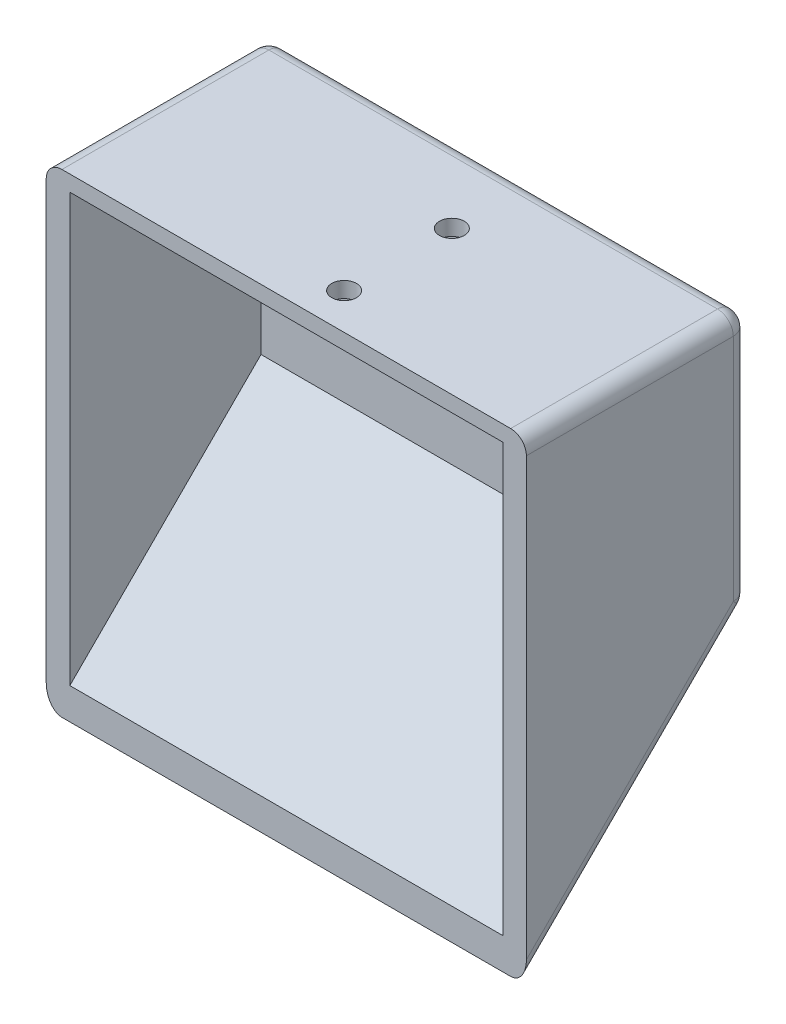
ISO-10303-21;
HEADER;
FILE_DESCRIPTION(('STEP AP214'),'2;1');
FILE_NAME('part.step','',(''),(''),'','','');
FILE_SCHEMA(('AUTOMOTIVE_DESIGN { 1 0 10303 214 1 1 1 1 }'));
ENDSEC;
DATA;
#1=APPLICATION_CONTEXT('core data for automotive mechanical design processes');
#2=APPLICATION_PROTOCOL_DEFINITION('international standard','automotive_design',2000,#1);
#3=PRODUCT_CONTEXT('',#1,'mechanical');
#4=PRODUCT('Part','Part','',(#3));
#5=PRODUCT_RELATED_PRODUCT_CATEGORY('part','',(#4));
#6=PRODUCT_DEFINITION_FORMATION('','',#4);
#7=PRODUCT_DEFINITION_CONTEXT('part definition',#1,'design');
#8=PRODUCT_DEFINITION('design','',#6,#7);
#9=PRODUCT_DEFINITION_SHAPE('','',#8);
#10=(LENGTH_UNIT() NAMED_UNIT(*) SI_UNIT(.MILLI.,.METRE.));
#11=(NAMED_UNIT(*) PLANE_ANGLE_UNIT() SI_UNIT($,.RADIAN.));
#12=(NAMED_UNIT(*) SI_UNIT($,.STERADIAN.) SOLID_ANGLE_UNIT());
#13=UNCERTAINTY_MEASURE_WITH_UNIT(LENGTH_MEASURE(1.E-05),#10,'distance_accuracy_value','');
#14=(GEOMETRIC_REPRESENTATION_CONTEXT(3) GLOBAL_UNCERTAINTY_ASSIGNED_CONTEXT((#13)) GLOBAL_UNIT_ASSIGNED_CONTEXT((#10,
#11,#12)) REPRESENTATION_CONTEXT('',''));
#15=CARTESIAN_POINT('',(0.,0.,0.));
#16=DIRECTION('',(0.,0.,1.));
#17=DIRECTION('',(1.,0.,0.));
#18=AXIS2_PLACEMENT_3D('',#15,#16,#17);
#19=CARTESIAN_POINT('',(0.,0.,5.08));
#20=DIRECTION('',(0.,0.,1.));
#21=DIRECTION('',(1.,0.,0.));
#22=AXIS2_PLACEMENT_3D('',#19,#20,#21);
#23=PLANE('',#22);
#24=DIRECTION('',(0.,-1.,0.));
#25=VECTOR('',#24,1.);
#26=CARTESIAN_POINT('',(-34.925,-19.05,5.08));
#27=LINE('',#26,#25);
#28=CARTESIAN_POINT('',(-34.925,19.05,5.08));
#29=VERTEX_POINT('',#28);
#30=CARTESIAN_POINT('',(-34.925,-19.05,5.08));
#31=VERTEX_POINT('',#30);
#32=EDGE_CURVE('E177',#29,#31,#27,.T.);
#33=ORIENTED_EDGE('',*,*,#32,.T.);
#34=DIRECTION('',(1.,0.,0.));
#35=VECTOR('',#34,1.);
#36=CARTESIAN_POINT('',(34.925,-19.05,5.08));
#37=LINE('',#36,#35);
#38=CARTESIAN_POINT('',(34.925,-19.05,5.08));
#39=VERTEX_POINT('',#38);
#40=EDGE_CURVE('E186',#31,#39,#37,.T.);
#41=ORIENTED_EDGE('',*,*,#40,.T.);
#42=DIRECTION('',(0.,1.,0.));
#43=VECTOR('',#42,1.);
#44=CARTESIAN_POINT('',(34.925,-19.05,5.08));
#45=LINE('',#44,#43);
#46=CARTESIAN_POINT('',(34.925,19.05,5.08));
#47=VERTEX_POINT('',#46);
#48=EDGE_CURVE('E188',#39,#47,#45,.T.);
#49=ORIENTED_EDGE('',*,*,#48,.T.);
#50=DIRECTION('',(-1.,0.,0.));
#51=VECTOR('',#50,1.);
#52=CARTESIAN_POINT('',(34.925,19.05,5.08));
#53=LINE('',#52,#51);
#54=EDGE_CURVE('E154',#47,#29,#53,.T.);
#55=ORIENTED_EDGE('',*,*,#54,.T.);
#56=EDGE_LOOP('',(#33,#41,#49,#55));
#57=FACE_BOUND('',#56,.T.);
#58=ADVANCED_FACE('F33',(#57),#23,.T.);
#59=CARTESIAN_POINT('',(0.,0.,0.));
#60=DIRECTION('',(0.,0.,1.));
#61=DIRECTION('',(1.,0.,0.));
#62=AXIS2_PLACEMENT_3D('',#59,#60,#61);
#63=PLANE('',#62);
#64=DIRECTION('',(0.,1.,0.));
#65=VECTOR('',#64,1.);
#66=CARTESIAN_POINT('',(36.195,0.,0.));
#67=LINE('',#66,#65);
#68=CARTESIAN_POINT('',(36.195,19.05,0.));
#69=VERTEX_POINT('',#68);
#70=CARTESIAN_POINT('',(36.195,-17.9978975515723,0.));
#71=VERTEX_POINT('',#70);
#72=EDGE_CURVE('E216',#69,#71,#67,.F.);
#73=ORIENTED_EDGE('',*,*,#72,.T.);
#74=DIRECTION('',(1.,0.,0.));
#75=VECTOR('',#74,1.);
#76=CARTESIAN_POINT('',(-38.735,-17.9978975515723,0.));
#77=LINE('',#76,#75);
#78=CARTESIAN_POINT('',(-36.195,-17.9978975515723,0.));
#79=VERTEX_POINT('',#78);
#80=EDGE_CURVE('E218',#71,#79,#77,.F.);
#81=ORIENTED_EDGE('',*,*,#80,.T.);
#82=DIRECTION('',(0.,-1.,0.));
#83=VECTOR('',#82,1.);
#84=CARTESIAN_POINT('',(-36.195,0.,0.));
#85=LINE('',#84,#83);
#86=CARTESIAN_POINT('',(-36.195,19.05,0.));
#87=VERTEX_POINT('',#86);
#88=EDGE_CURVE('E214',#79,#87,#85,.F.);
#89=ORIENTED_EDGE('',*,*,#88,.T.);
#90=DIRECTION('',(-1.,0.,0.));
#91=VECTOR('',#90,1.);
#92=CARTESIAN_POINT('',(0.,19.05,0.));
#93=LINE('',#92,#91);
#94=EDGE_CURVE('E212',#87,#69,#93,.F.);
#95=ORIENTED_EDGE('',*,*,#94,.T.);
#96=EDGE_LOOP('',(#73,#81,#89,#95));
#97=FACE_BOUND('',#96,.T.);
#98=ADVANCED_FACE('F293',(#97),#63,.F.);
#99=CARTESIAN_POINT('',(85.725,-19.05,5.08));
#100=DIRECTION('',(0.,0.707106781186549,0.707106781186546));
#101=DIRECTION('',(0.,-0.707106781186546,0.707106781186549));
#102=AXIS2_PLACEMENT_3D('',#99,#100,#101);
#103=PLANE('',#102);
#104=DIRECTION('',(0.,-0.707106781186546,0.707106781186549));
#105=VECTOR('',#104,1.);
#106=CARTESIAN_POINT('',(34.925,-19.05,5.08));
#107=LINE('',#106,#105);
#108=CARTESIAN_POINT('',(34.925,-49.8910244842765,35.9210244842766));
#109=VERTEX_POINT('',#108);
#110=EDGE_CURVE('E142',#39,#109,#107,.T.);
#111=ORIENTED_EDGE('',*,*,#110,.F.);
#112=ORIENTED_EDGE('',*,*,#40,.F.);
#113=DIRECTION('',(0.,0.707106781186546,-0.707106781186549));
#114=VECTOR('',#113,1.);
#115=CARTESIAN_POINT('',(-34.925,-19.05,5.08));
#116=LINE('',#115,#114);
#117=CARTESIAN_POINT('',(-34.925,-49.8910244842765,35.9210244842766));
#118=VERTEX_POINT('',#117);
#119=EDGE_CURVE('E174',#118,#31,#116,.T.);
#120=ORIENTED_EDGE('',*,*,#119,.F.);
#121=DIRECTION('',(-1.,0.,0.));
#122=VECTOR('',#121,1.);
#123=CARTESIAN_POINT('',(85.725,-49.8910244842764,35.9210244842766));
#124=LINE('',#123,#122);
#125=EDGE_CURVE('E178',#109,#118,#124,.T.);
#126=ORIENTED_EDGE('',*,*,#125,.F.);
#127=EDGE_LOOP('',(#111,#112,#120,#126));
#128=FACE_BOUND('',#127,.T.);
#129=ADVANCED_FACE('F336',(#128),#103,.T.);
#130=CARTESIAN_POINT('',(85.725,-54.9710244842766,35.9210244842766));
#131=DIRECTION('',(0.,0.,1.));
#132=DIRECTION('',(1.,0.,0.));
#133=AXIS2_PLACEMENT_3D('',#130,#131,#132);
#134=PLANE('',#133);
#135=DIRECTION('',(0.,1.,0.));
#136=VECTOR('',#135,1.);
#137=CARTESIAN_POINT('',(-34.925,19.05,35.9210244842766));
#138=LINE('',#137,#136);
#139=CARTESIAN_POINT('',(-34.925,19.05,35.9210244842766));
#140=VERTEX_POINT('',#139);
#141=EDGE_CURVE('E159',#118,#140,#138,.T.);
#142=ORIENTED_EDGE('',*,*,#141,.T.);
#143=DIRECTION('',(1.,0.,0.));
#144=VECTOR('',#143,1.);
#145=CARTESIAN_POINT('',(38.735,19.05,35.9210244842766));
#146=LINE('',#145,#144);
#147=CARTESIAN_POINT('',(34.925,19.05,35.9210244842766));
#148=VERTEX_POINT('',#147);
#149=EDGE_CURVE('E152',#140,#148,#146,.T.);
#150=ORIENTED_EDGE('',*,*,#149,.T.);
#151=DIRECTION('',(0.,-1.,0.));
#152=VECTOR('',#151,1.);
#153=CARTESIAN_POINT('',(34.925,19.05,35.9210244842766));
#154=LINE('',#153,#152);
#155=EDGE_CURVE('E135',#148,#109,#154,.T.);
#156=ORIENTED_EDGE('',*,*,#155,.T.);
#157=ORIENTED_EDGE('',*,*,#125,.T.);
#158=EDGE_LOOP('',(#142,#150,#156,#157));
#159=FACE_BOUND('',#158,.T.);
#160=DIRECTION('',(0.,1.,0.));
#161=VECTOR('',#160,1.);
#162=CARTESIAN_POINT('',(-38.735,19.05,35.9210244842766));
#163=LINE('',#162,#161);
#164=CARTESIAN_POINT('',(-38.735,-51.378922035849,35.9210244842766));
#165=VERTEX_POINT('',#164);
#166=CARTESIAN_POINT('',(-38.735,19.05,35.9210244842766));
#167=VERTEX_POINT('',#166);
#168=EDGE_CURVE('E146',#165,#167,#163,.T.);
#169=ORIENTED_EDGE('',*,*,#168,.F.);
#170=CARTESIAN_POINT('',(-36.195,-51.378922035849,35.9210244842766));
#171=DIRECTION('',(0.,0.,1.));
#172=DIRECTION('',(0.,1.,0.));
#173=AXIS2_PLACEMENT_3D('',#170,#171,#172);
#174=ELLIPSE('',#173,3.59210244842766,2.54);
#175=CARTESIAN_POINT('',(-36.195,-54.9710244842766,35.9210244842766));
#176=VERTEX_POINT('',#175);
#177=EDGE_CURVE('E204',#165,#176,#174,.T.);
#178=ORIENTED_EDGE('',*,*,#177,.T.);
#179=DIRECTION('',(-1.,0.,0.));
#180=VECTOR('',#179,1.);
#181=CARTESIAN_POINT('',(85.725,-54.9710244842766,35.9210244842766));
#182=LINE('',#181,#180);
#183=CARTESIAN_POINT('',(36.195,-54.9710244842766,35.9210244842766));
#184=VERTEX_POINT('',#183);
#185=EDGE_CURVE('E180',#184,#176,#182,.T.);
#186=ORIENTED_EDGE('',*,*,#185,.F.);
#187=CARTESIAN_POINT('',(36.195,-51.378922035849,35.9210244842766));
#188=DIRECTION('',(0.,0.,1.));
#189=DIRECTION('',(0.,-1.,0.));
#190=AXIS2_PLACEMENT_3D('',#187,#188,#189);
#191=ELLIPSE('',#190,3.59210244842766,2.54);
#192=CARTESIAN_POINT('',(38.735,-51.3789220358489,35.9210244842766));
#193=VERTEX_POINT('',#192);
#194=EDGE_CURVE('E202',#184,#193,#191,.T.);
#195=ORIENTED_EDGE('',*,*,#194,.T.);
#196=DIRECTION('',(0.,-1.,0.));
#197=VECTOR('',#196,1.);
#198=CARTESIAN_POINT('',(38.735,19.05,35.9210244842766));
#199=LINE('',#198,#197);
#200=CARTESIAN_POINT('',(38.735,19.05,35.9210244842766));
#201=VERTEX_POINT('',#200);
#202=EDGE_CURVE('E155',#201,#193,#199,.T.);
#203=ORIENTED_EDGE('',*,*,#202,.F.);
#204=CARTESIAN_POINT('',(36.195,19.05,35.9210244842766));
#205=DIRECTION('',(0.,0.,1.));
#206=DIRECTION('',(1.,0.,0.));
#207=AXIS2_PLACEMENT_3D('',#204,#205,#206);
#208=CIRCLE('',#207,2.54);
#209=CARTESIAN_POINT('',(36.195,21.59,35.9210244842766));
#210=VERTEX_POINT('',#209);
#211=EDGE_CURVE('E200',#201,#210,#208,.T.);
#212=ORIENTED_EDGE('',*,*,#211,.T.);
#213=DIRECTION('',(1.,0.,0.));
#214=VECTOR('',#213,1.);
#215=CARTESIAN_POINT('',(38.735,21.59,35.9210244842766));
#216=LINE('',#215,#214);
#217=CARTESIAN_POINT('',(-36.195,21.59,35.9210244842766));
#218=VERTEX_POINT('',#217);
#219=EDGE_CURVE('E161',#218,#210,#216,.T.);
#220=ORIENTED_EDGE('',*,*,#219,.F.);
#221=CARTESIAN_POINT('',(-36.195,19.05,35.9210244842766));
#222=DIRECTION('',(0.,0.,1.));
#223=DIRECTION('',(1.,0.,0.));
#224=AXIS2_PLACEMENT_3D('',#221,#222,#223);
#225=CIRCLE('',#224,2.54);
#226=EDGE_CURVE('E198',#218,#167,#225,.T.);
#227=ORIENTED_EDGE('',*,*,#226,.T.);
#228=EDGE_LOOP('',(#169,#178,#186,#195,#203,#212,#220,#227));
#229=FACE_BOUND('',#228,.T.);
#230=ADVANCED_FACE('F157',(#159,#229),#134,.T.);
#231=CARTESIAN_POINT('',(85.725,-19.05,0.));
#232=DIRECTION('',(0.,-0.707106781186547,-0.707106781186547));
#233=DIRECTION('',(0.,0.707106781186548,-0.707106781186548));
#234=AXIS2_PLACEMENT_3D('',#231,#232,#233);
#235=PLANE('',#234);
#236=ORIENTED_EDGE('',*,*,#185,.T.);
#237=DIRECTION('',(0.,-0.707106781186548,0.707106781186548));
#238=VECTOR('',#237,1.);
#239=CARTESIAN_POINT('',(-36.195,-19.05,0.));
#240=LINE('',#239,#238);
#241=CARTESIAN_POINT('',(-36.195,-19.7939487757862,0.743948775786169));
#242=VERTEX_POINT('',#241);
#243=EDGE_CURVE('E210',#176,#242,#240,.F.);
#244=ORIENTED_EDGE('',*,*,#243,.T.);
#245=DIRECTION('',(1.,0.,0.));
#246=VECTOR('',#245,1.);
#247=CARTESIAN_POINT('',(38.735,-19.7939487757862,0.743948775786169));
#248=LINE('',#247,#246);
#249=CARTESIAN_POINT('',(36.195,-19.7939487757862,0.743948775786169));
#250=VERTEX_POINT('',#249);
#251=EDGE_CURVE('E208',#242,#250,#248,.T.);
#252=ORIENTED_EDGE('',*,*,#251,.T.);
#253=DIRECTION('',(0.,0.707106781186548,-0.707106781186548));
#254=VECTOR('',#253,1.);
#255=CARTESIAN_POINT('',(36.195,-54.9710244842766,35.9210244842766));
#256=LINE('',#255,#254);
#257=EDGE_CURVE('E206',#250,#184,#256,.F.);
#258=ORIENTED_EDGE('',*,*,#257,.T.);
#259=EDGE_LOOP('',(#236,#244,#252,#258));
#260=FACE_BOUND('',#259,.T.);
#261=ADVANCED_FACE('F317',(#260),#235,.T.);
#262=CARTESIAN_POINT('',(34.925,0.,0.));
#263=DIRECTION('',(-1.,0.,0.));
#264=DIRECTION('',(0.,0.,1.));
#265=AXIS2_PLACEMENT_3D('',#262,#263,#264);
#266=PLANE('',#265);
#267=ORIENTED_EDGE('',*,*,#48,.F.);
#268=ORIENTED_EDGE('',*,*,#110,.T.);
#269=ORIENTED_EDGE('',*,*,#155,.F.);
#270=DIRECTION('',(0.,0.,1.));
#271=VECTOR('',#270,1.);
#272=CARTESIAN_POINT('',(34.925,19.05,0.));
#273=LINE('',#272,#271);
#274=EDGE_CURVE('E139',#47,#148,#273,.T.);
#275=ORIENTED_EDGE('',*,*,#274,.F.);
#276=EDGE_LOOP('',(#267,#268,#269,#275));
#277=FACE_BOUND('',#276,.T.);
#278=ADVANCED_FACE('F138',(#277),#266,.T.);
#279=CARTESIAN_POINT('',(38.735,0.,0.));
#280=DIRECTION('',(-1.,0.,0.));
#281=DIRECTION('',(0.,0.,1.));
#282=AXIS2_PLACEMENT_3D('',#279,#280,#281);
#283=PLANE('',#282);
#284=ORIENTED_EDGE('',*,*,#202,.T.);
#285=DIRECTION('',(0.,0.707106781186548,-0.707106781186548));
#286=VECTOR('',#285,1.);
#287=CARTESIAN_POINT('',(38.735,-17.2539487757862,1.79605122421383));
#288=LINE('',#287,#286);
#289=CARTESIAN_POINT('',(38.735,-17.9978975515723,2.54));
#290=VERTEX_POINT('',#289);
#291=EDGE_CURVE('E225',#193,#290,#288,.T.);
#292=ORIENTED_EDGE('',*,*,#291,.T.);
#293=DIRECTION('',(0.,1.,0.));
#294=VECTOR('',#293,1.);
#295=CARTESIAN_POINT('',(38.735,0.,2.54));
#296=LINE('',#295,#294);
#297=CARTESIAN_POINT('',(38.735,19.05,2.54));
#298=VERTEX_POINT('',#297);
#299=EDGE_CURVE('E221',#290,#298,#296,.T.);
#300=ORIENTED_EDGE('',*,*,#299,.T.);
#301=DIRECTION('',(0.,0.,-1.));
#302=VECTOR('',#301,1.);
#303=CARTESIAN_POINT('',(38.735,19.05,0.));
#304=LINE('',#303,#302);
#305=EDGE_CURVE('E223',#298,#201,#304,.F.);
#306=ORIENTED_EDGE('',*,*,#305,.T.);
#307=EDGE_LOOP('',(#284,#292,#300,#306));
#308=FACE_BOUND('',#307,.T.);
#309=ADVANCED_FACE('F274',(#308),#283,.F.);
#310=CARTESIAN_POINT('',(-38.735,0.,0.));
#311=DIRECTION('',(1.,0.,0.));
#312=DIRECTION('',(0.,0.,-1.));
#313=AXIS2_PLACEMENT_3D('',#310,#311,#312);
#314=PLANE('',#313);
#315=DIRECTION('',(0.,-1.,0.));
#316=VECTOR('',#315,1.);
#317=CARTESIAN_POINT('',(-38.735,0.,2.54));
#318=LINE('',#317,#316);
#319=CARTESIAN_POINT('',(-38.735,19.05,2.54));
#320=VERTEX_POINT('',#319);
#321=CARTESIAN_POINT('',(-38.735,-17.9978975515723,2.54));
#322=VERTEX_POINT('',#321);
#323=EDGE_CURVE('E193',#320,#322,#318,.T.);
#324=ORIENTED_EDGE('',*,*,#323,.T.);
#325=DIRECTION('',(0.,-0.707106781186548,0.707106781186548));
#326=VECTOR('',#325,1.);
#327=CARTESIAN_POINT('',(-38.735,-53.1749732600628,37.7170757084904));
#328=LINE('',#327,#326);
#329=EDGE_CURVE('E195',#322,#165,#328,.T.);
#330=ORIENTED_EDGE('',*,*,#329,.T.);
#331=ORIENTED_EDGE('',*,*,#168,.T.);
#332=DIRECTION('',(0.,0.,1.));
#333=VECTOR('',#332,1.);
#334=CARTESIAN_POINT('',(-38.735,19.05,0.));
#335=LINE('',#334,#333);
#336=EDGE_CURVE('E191',#167,#320,#335,.F.);
#337=ORIENTED_EDGE('',*,*,#336,.T.);
#338=EDGE_LOOP('',(#324,#330,#331,#337));
#339=FACE_BOUND('',#338,.T.);
#340=ADVANCED_FACE('F309',(#339),#314,.F.);
#341=CARTESIAN_POINT('',(-34.925,0.,0.));
#342=DIRECTION('',(1.,0.,0.));
#343=DIRECTION('',(0.,0.,-1.));
#344=AXIS2_PLACEMENT_3D('',#341,#342,#343);
#345=PLANE('',#344);
#346=ORIENTED_EDGE('',*,*,#141,.F.);
#347=ORIENTED_EDGE('',*,*,#119,.T.);
#348=ORIENTED_EDGE('',*,*,#32,.F.);
#349=DIRECTION('',(0.,0.,-1.));
#350=VECTOR('',#349,1.);
#351=CARTESIAN_POINT('',(-34.925,19.05,5.08));
#352=LINE('',#351,#350);
#353=EDGE_CURVE('E170',#140,#29,#352,.T.);
#354=ORIENTED_EDGE('',*,*,#353,.F.);
#355=EDGE_LOOP('',(#346,#347,#348,#354));
#356=FACE_BOUND('',#355,.T.);
#357=ADVANCED_FACE('F359',(#356),#345,.T.);
#358=CARTESIAN_POINT('',(0.,21.59,0.));
#359=DIRECTION('',(0.,-1.,0.));
#360=DIRECTION('',(1.,0.,0.));
#361=AXIS2_PLACEMENT_3D('',#358,#359,#360);
#362=PLANE('',#361);
#363=CARTESIAN_POINT('',(3.48386400000001,21.59,12.7));
#364=DIRECTION('',(0.,1.,0.));
#365=DIRECTION('',(-1.,0.,0.));
#366=AXIS2_PLACEMENT_3D('',#363,#364,#365);
#367=CIRCLE('',#366,2.);
#368=CARTESIAN_POINT('',(1.48386400000001,21.59,12.7));
#369=VERTEX_POINT('',#368);
#370=EDGE_CURVE('E577',#369,#369,#367,.T.);
#371=ORIENTED_EDGE('',*,*,#370,.F.);
#372=EDGE_LOOP('',(#371));
#373=FACE_BOUND('',#372,.T.);
#374=CARTESIAN_POINT('',(3.48386400000002,21.59,30.0790244842766));
#375=DIRECTION('',(0.,1.,0.));
#376=DIRECTION('',(-1.,0.,0.));
#377=AXIS2_PLACEMENT_3D('',#374,#375,#376);
#378=CIRCLE('',#377,2.);
#379=CARTESIAN_POINT('',(1.48386400000001,21.59,30.0790244842766));
#380=VERTEX_POINT('',#379);
#381=EDGE_CURVE('E578',#380,#380,#378,.T.);
#382=ORIENTED_EDGE('',*,*,#381,.F.);
#383=EDGE_LOOP('',(#382));
#384=FACE_BOUND('',#383,.T.);
#385=ORIENTED_EDGE('',*,*,#219,.T.);
#386=DIRECTION('',(0.,0.,-1.));
#387=VECTOR('',#386,1.);
#388=CARTESIAN_POINT('',(36.195,21.59,0.));
#389=LINE('',#388,#387);
#390=CARTESIAN_POINT('',(36.195,21.59,2.54));
#391=VERTEX_POINT('',#390);
#392=EDGE_CURVE('E11',#210,#391,#389,.T.);
#393=ORIENTED_EDGE('',*,*,#392,.T.);
#394=DIRECTION('',(-1.,0.,0.));
#395=VECTOR('',#394,1.);
#396=CARTESIAN_POINT('',(0.,21.59,2.54));
#397=LINE('',#396,#395);
#398=CARTESIAN_POINT('',(-36.195,21.59,2.54));
#399=VERTEX_POINT('',#398);
#400=EDGE_CURVE('E49',#391,#399,#397,.T.);
#401=ORIENTED_EDGE('',*,*,#400,.T.);
#402=DIRECTION('',(0.,0.,1.));
#403=VECTOR('',#402,1.);
#404=CARTESIAN_POINT('',(-36.195,21.59,0.));
#405=LINE('',#404,#403);
#406=EDGE_CURVE('E42',#399,#218,#405,.T.);
#407=ORIENTED_EDGE('',*,*,#406,.T.);
#408=EDGE_LOOP('',(#385,#393,#401,#407));
#409=FACE_BOUND('',#408,.T.);
#410=ADVANCED_FACE('F307',(#373,#384,#409),#362,.F.);
#411=CARTESIAN_POINT('',(0.,19.05,0.));
#412=DIRECTION('',(0.,-1.,0.));
#413=DIRECTION('',(1.,0.,0.));
#414=AXIS2_PLACEMENT_3D('',#411,#412,#413);
#415=PLANE('',#414);
#416=CARTESIAN_POINT('',(3.48386400000001,19.05,12.7));
#417=DIRECTION('',(0.,-1.,0.));
#418=DIRECTION('',(1.,0.,0.));
#419=AXIS2_PLACEMENT_3D('',#416,#417,#418);
#420=CIRCLE('',#419,2.);
#421=CARTESIAN_POINT('',(5.48386400000001,19.05,12.7));
#422=VERTEX_POINT('',#421);
#423=EDGE_CURVE('E233',#422,#422,#420,.F.);
#424=ORIENTED_EDGE('',*,*,#423,.T.);
#425=EDGE_LOOP('',(#424));
#426=FACE_BOUND('',#425,.T.);
#427=CARTESIAN_POINT('',(3.48386400000002,19.05,30.0790244842766));
#428=DIRECTION('',(0.,-1.,0.));
#429=DIRECTION('',(1.,0.,0.));
#430=AXIS2_PLACEMENT_3D('',#427,#428,#429);
#431=CIRCLE('',#430,2.);
#432=CARTESIAN_POINT('',(5.48386400000002,19.05,30.0790244842766));
#433=VERTEX_POINT('',#432);
#434=EDGE_CURVE('E576',#433,#433,#431,.F.);
#435=ORIENTED_EDGE('',*,*,#434,.T.);
#436=EDGE_LOOP('',(#435));
#437=FACE_BOUND('',#436,.T.);
#438=ORIENTED_EDGE('',*,*,#149,.F.);
#439=ORIENTED_EDGE('',*,*,#353,.T.);
#440=ORIENTED_EDGE('',*,*,#54,.F.);
#441=ORIENTED_EDGE('',*,*,#274,.T.);
#442=EDGE_LOOP('',(#438,#439,#440,#441));
#443=FACE_BOUND('',#442,.T.);
#444=ADVANCED_FACE('F150',(#426,#437,#443),#415,.T.);
#445=CARTESIAN_POINT('',(36.195,19.05,0.));
#446=DIRECTION('',(0.,0.,-1.));
#447=DIRECTION('',(-1.,0.,0.));
#448=AXIS2_PLACEMENT_3D('',#445,#446,#447);
#449=CYLINDRICAL_SURFACE('',#448,2.54);
#450=CARTESIAN_POINT('',(36.195,19.05,2.54));
#451=DIRECTION('',(0.,0.,-1.));
#452=DIRECTION('',(-1.,0.,0.));
#453=AXIS2_PLACEMENT_3D('',#450,#451,#452);
#454=CIRCLE('',#453,2.54);
#455=EDGE_CURVE('E37',#391,#298,#454,.T.);
#456=ORIENTED_EDGE('',*,*,#455,.F.);
#457=ORIENTED_EDGE('',*,*,#392,.F.);
#458=ORIENTED_EDGE('',*,*,#211,.F.);
#459=ORIENTED_EDGE('',*,*,#305,.F.);
#460=EDGE_LOOP('',(#456,#457,#458,#459));
#461=FACE_BOUND('',#460,.T.);
#462=ADVANCED_FACE('F35',(#461),#449,.T.);
#463=CARTESIAN_POINT('',(36.195,19.05,2.54));
#464=DIRECTION('',(1.,0.,0.));
#465=DIRECTION('',(0.,0.,-1.));
#466=AXIS2_PLACEMENT_3D('',#463,#464,#465);
#467=SPHERICAL_SURFACE('',#466,2.54);
#468=CARTESIAN_POINT('',(36.195,19.05,2.54));
#469=DIRECTION('',(1.,0.,0.));
#470=DIRECTION('',(0.,0.,-1.));
#471=AXIS2_PLACEMENT_3D('',#468,#469,#470);
#472=CIRCLE('',#471,2.54);
#473=EDGE_CURVE('E256',#391,#69,#472,.F.);
#474=ORIENTED_EDGE('',*,*,#473,.F.);
#475=ORIENTED_EDGE('',*,*,#455,.T.);
#476=CARTESIAN_POINT('',(36.195,19.05,2.54));
#477=DIRECTION('',(0.,1.,0.));
#478=DIRECTION('',(0.,0.,1.));
#479=AXIS2_PLACEMENT_3D('',#476,#477,#478);
#480=CIRCLE('',#479,2.54);
#481=EDGE_CURVE('E165',#69,#298,#480,.F.);
#482=ORIENTED_EDGE('',*,*,#481,.F.);
#483=EDGE_LOOP('',(#474,#475,#482));
#484=FACE_BOUND('',#483,.T.);
#485=ADVANCED_FACE('F268',(#484),#467,.T.);
#486=CARTESIAN_POINT('',(36.195,-7.72894877578617,-7.72894877578617));
#487=DIRECTION('',(0.,-0.707106781186548,0.707106781186548));
#488=DIRECTION('',(0.,-0.707106781186548,-0.707106781186548));
#489=AXIS2_PLACEMENT_3D('',#486,#487,#488);
#490=CYLINDRICAL_SURFACE('',#489,2.54);
#491=ORIENTED_EDGE('',*,*,#194,.F.);
#492=ORIENTED_EDGE('',*,*,#257,.F.);
#493=CARTESIAN_POINT('',(36.195,-17.9978975515723,2.54));
#494=DIRECTION('',(0.,0.707106781186548,-0.707106781186548));
#495=DIRECTION('',(0.,0.707106781186548,0.707106781186548));
#496=AXIS2_PLACEMENT_3D('',#493,#494,#495);
#497=CIRCLE('',#496,2.54);
#498=EDGE_CURVE('E253',#290,#250,#497,.T.);
#499=ORIENTED_EDGE('',*,*,#498,.F.);
#500=ORIENTED_EDGE('',*,*,#291,.F.);
#501=EDGE_LOOP('',(#491,#492,#499,#500));
#502=FACE_BOUND('',#501,.T.);
#503=ADVANCED_FACE('F282',(#502),#490,.T.);
#504=CARTESIAN_POINT('',(36.195,0.,2.54));
#505=DIRECTION('',(0.,1.,0.));
#506=DIRECTION('',(0.,0.,1.));
#507=AXIS2_PLACEMENT_3D('',#504,#505,#506);
#508=CYLINDRICAL_SURFACE('',#507,2.54);
#509=ORIENTED_EDGE('',*,*,#481,.T.);
#510=ORIENTED_EDGE('',*,*,#299,.F.);
#511=CARTESIAN_POINT('',(36.195,-17.9978975515723,2.54));
#512=DIRECTION('',(0.,-1.,0.));
#513=DIRECTION('',(0.,0.,-1.));
#514=AXIS2_PLACEMENT_3D('',#511,#512,#513);
#515=CIRCLE('',#514,2.54);
#516=EDGE_CURVE('E250',#71,#290,#515,.T.);
#517=ORIENTED_EDGE('',*,*,#516,.F.);
#518=ORIENTED_EDGE('',*,*,#72,.F.);
#519=EDGE_LOOP('',(#509,#510,#517,#518));
#520=FACE_BOUND('',#519,.T.);
#521=ADVANCED_FACE('F263',(#520),#508,.T.);
#522=CARTESIAN_POINT('',(0.,19.05,2.54));
#523=DIRECTION('',(-1.,0.,0.));
#524=DIRECTION('',(0.,-1.,0.));
#525=AXIS2_PLACEMENT_3D('',#522,#523,#524);
#526=CYLINDRICAL_SURFACE('',#525,2.54);
#527=ORIENTED_EDGE('',*,*,#473,.T.);
#528=ORIENTED_EDGE('',*,*,#94,.F.);
#529=CARTESIAN_POINT('',(-36.195,19.05,2.54));
#530=DIRECTION('',(-1.,0.,0.));
#531=DIRECTION('',(0.,0.,1.));
#532=AXIS2_PLACEMENT_3D('',#529,#530,#531);
#533=CIRCLE('',#532,2.54);
#534=EDGE_CURVE('E247',#399,#87,#533,.T.);
#535=ORIENTED_EDGE('',*,*,#534,.F.);
#536=ORIENTED_EDGE('',*,*,#400,.F.);
#537=EDGE_LOOP('',(#527,#528,#535,#536));
#538=FACE_BOUND('',#537,.T.);
#539=ADVANCED_FACE('F297',(#538),#526,.T.);
#540=CARTESIAN_POINT('',(-36.195,19.05,0.));
#541=DIRECTION('',(0.,0.,1.));
#542=DIRECTION('',(1.,0.,0.));
#543=AXIS2_PLACEMENT_3D('',#540,#541,#542);
#544=CYLINDRICAL_SURFACE('',#543,2.54);
#545=ORIENTED_EDGE('',*,*,#226,.F.);
#546=ORIENTED_EDGE('',*,*,#406,.F.);
#547=CARTESIAN_POINT('',(-36.195,19.05,2.54));
#548=DIRECTION('',(0.,0.,-1.));
#549=DIRECTION('',(-1.,0.,0.));
#550=AXIS2_PLACEMENT_3D('',#547,#548,#549);
#551=CIRCLE('',#550,2.54);
#552=EDGE_CURVE('E244',#320,#399,#551,.T.);
#553=ORIENTED_EDGE('',*,*,#552,.F.);
#554=ORIENTED_EDGE('',*,*,#336,.F.);
#555=EDGE_LOOP('',(#545,#546,#553,#554));
#556=FACE_BOUND('',#555,.T.);
#557=ADVANCED_FACE('F306',(#556),#544,.T.);
#558=CARTESIAN_POINT('',(36.195,-17.9978975515723,2.54));
#559=DIRECTION('',(1.,0.,0.));
#560=DIRECTION('',(0.,0.,-1.));
#561=AXIS2_PLACEMENT_3D('',#558,#559,#560);
#562=SPHERICAL_SURFACE('',#561,2.54);
#563=ORIENTED_EDGE('',*,*,#516,.T.);
#564=ORIENTED_EDGE('',*,*,#498,.T.);
#565=CARTESIAN_POINT('',(36.195,-17.9978975515723,2.54));
#566=DIRECTION('',(1.,0.,0.));
#567=DIRECTION('',(0.,0.,-1.));
#568=AXIS2_PLACEMENT_3D('',#565,#566,#567);
#569=CIRCLE('',#568,2.54);
#570=EDGE_CURVE('E241',#71,#250,#569,.F.);
#571=ORIENTED_EDGE('',*,*,#570,.F.);
#572=EDGE_LOOP('',(#563,#564,#571));
#573=FACE_BOUND('',#572,.T.);
#574=ADVANCED_FACE('F285',(#573),#562,.T.);
#575=CARTESIAN_POINT('',(-36.195,19.05,2.54));
#576=DIRECTION('',(0.,1.,0.));
#577=DIRECTION('',(0.,0.,1.));
#578=AXIS2_PLACEMENT_3D('',#575,#576,#577);
#579=SPHERICAL_SURFACE('',#578,2.54);
#580=ORIENTED_EDGE('',*,*,#552,.T.);
#581=ORIENTED_EDGE('',*,*,#534,.T.);
#582=CARTESIAN_POINT('',(-36.195,19.05,2.54));
#583=DIRECTION('',(0.,1.,0.));
#584=DIRECTION('',(0.,0.,1.));
#585=AXIS2_PLACEMENT_3D('',#582,#583,#584);
#586=CIRCLE('',#585,2.54);
#587=EDGE_CURVE('E238',#320,#87,#586,.F.);
#588=ORIENTED_EDGE('',*,*,#587,.F.);
#589=EDGE_LOOP('',(#580,#581,#588));
#590=FACE_BOUND('',#589,.T.);
#591=ADVANCED_FACE('F301',(#590),#579,.T.);
#592=CARTESIAN_POINT('',(85.725,-17.9978975515723,2.54));
#593=DIRECTION('',(-1.,0.,0.));
#594=DIRECTION('',(0.,0.,1.));
#595=AXIS2_PLACEMENT_3D('',#592,#593,#594);
#596=CYLINDRICAL_SURFACE('',#595,2.54);
#597=ORIENTED_EDGE('',*,*,#570,.T.);
#598=ORIENTED_EDGE('',*,*,#251,.F.);
#599=CARTESIAN_POINT('',(-36.195,-17.9978975515723,2.54));
#600=DIRECTION('',(-1.,0.,0.));
#601=DIRECTION('',(0.,0.,1.));
#602=AXIS2_PLACEMENT_3D('',#599,#600,#601);
#603=CIRCLE('',#602,2.54);
#604=EDGE_CURVE('E235',#79,#242,#603,.T.);
#605=ORIENTED_EDGE('',*,*,#604,.F.);
#606=ORIENTED_EDGE('',*,*,#80,.F.);
#607=EDGE_LOOP('',(#597,#598,#605,#606));
#608=FACE_BOUND('',#607,.T.);
#609=ADVANCED_FACE('F290',(#608),#596,.T.);
#610=CARTESIAN_POINT('',(-36.195,0.,2.54));
#611=DIRECTION('',(0.,-1.,0.));
#612=DIRECTION('',(0.,0.,-1.));
#613=AXIS2_PLACEMENT_3D('',#610,#611,#612);
#614=CYLINDRICAL_SURFACE('',#613,2.54);
#615=ORIENTED_EDGE('',*,*,#587,.T.);
#616=ORIENTED_EDGE('',*,*,#88,.F.);
#617=CARTESIAN_POINT('',(-36.195,-17.9978975515723,2.54));
#618=DIRECTION('',(0.,-1.,0.));
#619=DIRECTION('',(0.,0.,-1.));
#620=AXIS2_PLACEMENT_3D('',#617,#618,#619);
#621=CIRCLE('',#620,2.54);
#622=EDGE_CURVE('E232',#322,#79,#621,.T.);
#623=ORIENTED_EDGE('',*,*,#622,.F.);
#624=ORIENTED_EDGE('',*,*,#323,.F.);
#625=EDGE_LOOP('',(#615,#616,#623,#624));
#626=FACE_BOUND('',#625,.T.);
#627=ADVANCED_FACE('F321',(#626),#614,.T.);
#628=CARTESIAN_POINT('',(-36.195,-17.9978975515723,2.54));
#629=DIRECTION('',(-1.,0.,0.));
#630=DIRECTION('',(0.,0.,1.));
#631=AXIS2_PLACEMENT_3D('',#628,#629,#630);
#632=SPHERICAL_SURFACE('',#631,2.54);
#633=ORIENTED_EDGE('',*,*,#622,.T.);
#634=ORIENTED_EDGE('',*,*,#604,.T.);
#635=CARTESIAN_POINT('',(-36.195,-17.9978975515723,2.54));
#636=DIRECTION('',(0.,0.707106781186547,-0.707106781186548));
#637=DIRECTION('',(0.,0.707106781186548,0.707106781186547));
#638=AXIS2_PLACEMENT_3D('',#635,#636,#637);
#639=CIRCLE('',#638,2.54);
#640=EDGE_CURVE('E229',#322,#242,#639,.F.);
#641=ORIENTED_EDGE('',*,*,#640,.F.);
#642=EDGE_LOOP('',(#633,#634,#641));
#643=FACE_BOUND('',#642,.T.);
#644=ADVANCED_FACE('F319',(#643),#632,.T.);
#645=CARTESIAN_POINT('',(-36.195,-7.72894877578617,-7.72894877578617));
#646=DIRECTION('',(0.,0.707106781186548,-0.707106781186548));
#647=DIRECTION('',(0.,0.707106781186548,0.707106781186548));
#648=AXIS2_PLACEMENT_3D('',#645,#646,#647);
#649=CYLINDRICAL_SURFACE('',#648,2.54);
#650=ORIENTED_EDGE('',*,*,#640,.T.);
#651=ORIENTED_EDGE('',*,*,#243,.F.);
#652=ORIENTED_EDGE('',*,*,#177,.F.);
#653=ORIENTED_EDGE('',*,*,#329,.F.);
#654=EDGE_LOOP('',(#650,#651,#652,#653));
#655=FACE_BOUND('',#654,.T.);
#656=ADVANCED_FACE('F313',(#655),#649,.T.);
#657=CARTESIAN_POINT('',(3.48386400000002,13.3931457505076,30.0790244842766));
#658=DIRECTION('',(0.,1.,0.));
#659=DIRECTION('',(-1.,0.,0.));
#660=AXIS2_PLACEMENT_3D('',#657,#658,#659);
#661=CYLINDRICAL_SURFACE('',#660,2.);
#662=ORIENTED_EDGE('',*,*,#381,.T.);
#663=EDGE_LOOP('',(#662));
#664=FACE_BOUND('',#663,.T.);
#665=ORIENTED_EDGE('',*,*,#434,.F.);
#666=EDGE_LOOP('',(#665));
#667=FACE_BOUND('',#666,.T.);
#668=ADVANCED_FACE('F342',(#664,#667),#661,.F.);
#669=CARTESIAN_POINT('',(3.48386400000001,13.3931457505076,12.7));
#670=DIRECTION('',(0.,1.,0.));
#671=DIRECTION('',(-1.,0.,0.));
#672=AXIS2_PLACEMENT_3D('',#669,#670,#671);
#673=CYLINDRICAL_SURFACE('',#672,2.);
#674=ORIENTED_EDGE('',*,*,#370,.T.);
#675=EDGE_LOOP('',(#674));
#676=FACE_BOUND('',#675,.T.);
#677=ORIENTED_EDGE('',*,*,#423,.F.);
#678=EDGE_LOOP('',(#677));
#679=FACE_BOUND('',#678,.T.);
#680=ADVANCED_FACE('F346',(#676,#679),#673,.F.);
#681=CLOSED_SHELL('',(#58,#98,#129,#230,#261,#278,#309,#340,#357,#410,#444,#462,#485,#503,#521,
#539,#557,#574,#591,#609,#627,#644,#656,#668,#680));
#682=MANIFOLD_SOLID_BREP('B2',#681);
#683=ADVANCED_BREP_SHAPE_REPRESENTATION('',(#18,#682),#14);
#684=SHAPE_DEFINITION_REPRESENTATION(#9,#683);
ENDSEC;
END-ISO-10303-21;
